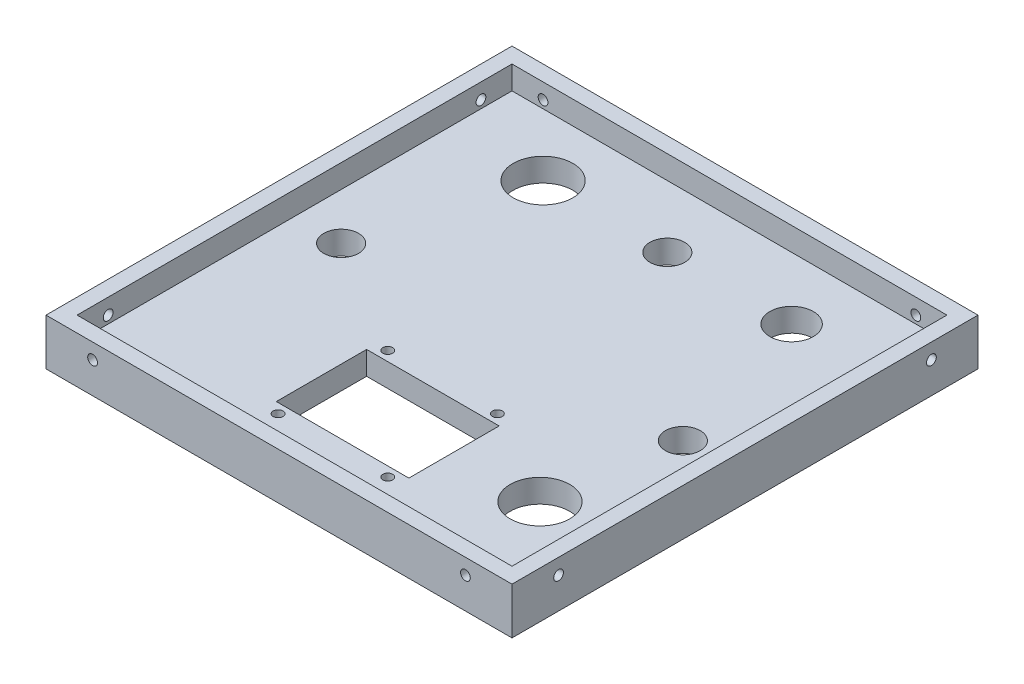
ISO-10303-21;
HEADER;
FILE_DESCRIPTION(('STEP AP214'),'2;1');
FILE_NAME('part.step','',(''),(''),'','','');
FILE_SCHEMA(('AUTOMOTIVE_DESIGN { 1 0 10303 214 1 1 1 1 }'));
ENDSEC;
DATA;
#1=APPLICATION_CONTEXT('core data for automotive mechanical design processes');
#2=APPLICATION_PROTOCOL_DEFINITION('international standard','automotive_design',2000,#1);
#3=PRODUCT_CONTEXT('',#1,'mechanical');
#4=PRODUCT('Part','Part','',(#3));
#5=PRODUCT_RELATED_PRODUCT_CATEGORY('part','',(#4));
#6=PRODUCT_DEFINITION_FORMATION('','',#4);
#7=PRODUCT_DEFINITION_CONTEXT('part definition',#1,'design');
#8=PRODUCT_DEFINITION('design','',#6,#7);
#9=PRODUCT_DEFINITION_SHAPE('','',#8);
#10=(LENGTH_UNIT() NAMED_UNIT(*) SI_UNIT(.MILLI.,.METRE.));
#11=(NAMED_UNIT(*) PLANE_ANGLE_UNIT() SI_UNIT($,.RADIAN.));
#12=(NAMED_UNIT(*) SI_UNIT($,.STERADIAN.) SOLID_ANGLE_UNIT());
#13=UNCERTAINTY_MEASURE_WITH_UNIT(LENGTH_MEASURE(1.E-05),#10,'distance_accuracy_value','');
#14=(GEOMETRIC_REPRESENTATION_CONTEXT(3) GLOBAL_UNCERTAINTY_ASSIGNED_CONTEXT((#13)) GLOBAL_UNIT_ASSIGNED_CONTEXT((#10,
#11,#12)) REPRESENTATION_CONTEXT('',''));
#15=CARTESIAN_POINT('',(0.,0.,0.));
#16=DIRECTION('',(0.,0.,1.));
#17=DIRECTION('',(1.,0.,0.));
#18=AXIS2_PLACEMENT_3D('',#15,#16,#17);
#19=CARTESIAN_POINT('',(0.,9.525,0.));
#20=DIRECTION('',(0.,1.,0.));
#21=DIRECTION('',(0.,0.,1.));
#22=AXIS2_PLACEMENT_3D('',#19,#20,#21);
#23=PLANE('',#22);
#24=DIRECTION('',(0.,0.,1.));
#25=VECTOR('',#24,1.);
#26=CARTESIAN_POINT('',(-47.625,9.525,-47.625));
#27=LINE('',#26,#25);
#28=CARTESIAN_POINT('',(-47.625,9.525,-47.625));
#29=VERTEX_POINT('',#28);
#30=CARTESIAN_POINT('',(-47.625,9.525,47.625));
#31=VERTEX_POINT('',#30);
#32=EDGE_CURVE('E243',#29,#31,#27,.T.);
#33=ORIENTED_EDGE('',*,*,#32,.T.);
#34=DIRECTION('',(1.,0.,0.));
#35=VECTOR('',#34,1.);
#36=CARTESIAN_POINT('',(-47.625,9.525,47.625));
#37=LINE('',#36,#35);
#38=CARTESIAN_POINT('',(47.625,9.525,47.625));
#39=VERTEX_POINT('',#38);
#40=EDGE_CURVE('E247',#31,#39,#37,.T.);
#41=ORIENTED_EDGE('',*,*,#40,.T.);
#42=DIRECTION('',(0.,0.,-1.));
#43=VECTOR('',#42,1.);
#44=CARTESIAN_POINT('',(47.625,9.525,-47.625));
#45=LINE('',#44,#43);
#46=CARTESIAN_POINT('',(47.625,9.525,-47.625));
#47=VERTEX_POINT('',#46);
#48=EDGE_CURVE('E252',#39,#47,#45,.T.);
#49=ORIENTED_EDGE('',*,*,#48,.T.);
#50=DIRECTION('',(-1.,0.,0.));
#51=VECTOR('',#50,1.);
#52=CARTESIAN_POINT('',(-47.625,9.525,-47.625));
#53=LINE('',#52,#51);
#54=EDGE_CURVE('E256',#47,#29,#53,.T.);
#55=ORIENTED_EDGE('',*,*,#54,.T.);
#56=EDGE_LOOP('',(#33,#41,#49,#55));
#57=FACE_BOUND('',#56,.T.);
#58=DIRECTION('',(1.,0.,0.));
#59=VECTOR('',#58,1.);
#60=CARTESIAN_POINT('',(-44.45,9.525,44.45));
#61=LINE('',#60,#59);
#62=CARTESIAN_POINT('',(-44.45,9.525,44.45));
#63=VERTEX_POINT('',#62);
#64=CARTESIAN_POINT('',(44.45,9.525,44.45));
#65=VERTEX_POINT('',#64);
#66=EDGE_CURVE('E356',#63,#65,#61,.T.);
#67=ORIENTED_EDGE('',*,*,#66,.F.);
#68=DIRECTION('',(0.,0.,1.));
#69=VECTOR('',#68,1.);
#70=CARTESIAN_POINT('',(-44.45,9.525,-44.45));
#71=LINE('',#70,#69);
#72=CARTESIAN_POINT('',(-44.45,9.525,-44.45));
#73=VERTEX_POINT('',#72);
#74=EDGE_CURVE('E350',#73,#63,#71,.T.);
#75=ORIENTED_EDGE('',*,*,#74,.F.);
#76=DIRECTION('',(-1.,0.,0.));
#77=VECTOR('',#76,1.);
#78=CARTESIAN_POINT('',(-44.45,9.525,-44.45));
#79=LINE('',#78,#77);
#80=CARTESIAN_POINT('',(44.45,9.525,-44.45));
#81=VERTEX_POINT('',#80);
#82=EDGE_CURVE('E363',#81,#73,#79,.T.);
#83=ORIENTED_EDGE('',*,*,#82,.F.);
#84=DIRECTION('',(0.,0.,-1.));
#85=VECTOR('',#84,1.);
#86=CARTESIAN_POINT('',(44.45,9.525,-44.45));
#87=LINE('',#86,#85);
#88=EDGE_CURVE('E359',#65,#81,#87,.T.);
#89=ORIENTED_EDGE('',*,*,#88,.F.);
#90=EDGE_LOOP('',(#67,#75,#83,#89));
#91=FACE_BOUND('',#90,.T.);
#92=ADVANCED_FACE('F45',(#57,#91),#23,.T.);
#93=CARTESIAN_POINT('',(-44.45,9.525,-44.45));
#94=DIRECTION('',(1.,0.,0.));
#95=DIRECTION('',(0.,0.,-1.));
#96=AXIS2_PLACEMENT_3D('',#93,#94,#95);
#97=PLANE('',#96);
#98=DIRECTION('',(0.,0.,1.));
#99=VECTOR('',#98,1.);
#100=CARTESIAN_POINT('',(-44.45,4.7625,-44.45));
#101=LINE('',#100,#99);
#102=CARTESIAN_POINT('',(-44.45,4.7625,-44.45));
#103=VERTEX_POINT('',#102);
#104=CARTESIAN_POINT('',(-44.45,4.7625,44.45));
#105=VERTEX_POINT('',#104);
#106=EDGE_CURVE('E305',#103,#105,#101,.T.);
#107=ORIENTED_EDGE('',*,*,#106,.F.);
#108=DIRECTION('',(0.,-1.,0.));
#109=VECTOR('',#108,1.);
#110=CARTESIAN_POINT('',(-44.45,9.525,-44.45));
#111=LINE('',#110,#109);
#112=EDGE_CURVE('E366',#73,#103,#111,.T.);
#113=ORIENTED_EDGE('',*,*,#112,.F.);
#114=ORIENTED_EDGE('',*,*,#74,.T.);
#115=DIRECTION('',(0.,-1.,0.));
#116=VECTOR('',#115,1.);
#117=CARTESIAN_POINT('',(-44.45,9.525,44.45));
#118=LINE('',#117,#116);
#119=EDGE_CURVE('E11',#63,#105,#118,.T.);
#120=ORIENTED_EDGE('',*,*,#119,.T.);
#121=EDGE_LOOP('',(#107,#113,#114,#120));
#122=FACE_BOUND('',#121,.T.);
#123=CARTESIAN_POINT('',(-44.4500000000001,6.35,38.0999999999998));
#124=DIRECTION('',(-1.,0.,0.));
#125=DIRECTION('',(0.,0.,-1.));
#126=AXIS2_PLACEMENT_3D('',#123,#124,#125);
#127=CIRCLE('',#126,0.99949);
#128=CARTESIAN_POINT('',(-44.4500000000001,6.35,37.1005099999998));
#129=VERTEX_POINT('',#128);
#130=EDGE_CURVE('E334',#129,#129,#127,.T.);
#131=ORIENTED_EDGE('',*,*,#130,.T.);
#132=EDGE_LOOP('',(#131));
#133=FACE_BOUND('',#132,.T.);
#134=CARTESIAN_POINT('',(-44.4499999999999,6.35,-38.1000000000002));
#135=DIRECTION('',(-1.,0.,0.));
#136=DIRECTION('',(0.,0.,1.));
#137=AXIS2_PLACEMENT_3D('',#134,#135,#136);
#138=CIRCLE('',#137,0.99949);
#139=CARTESIAN_POINT('',(-44.4499999999999,6.35,-37.1005100000001));
#140=VERTEX_POINT('',#139);
#141=EDGE_CURVE('E338',#140,#140,#138,.T.);
#142=ORIENTED_EDGE('',*,*,#141,.T.);
#143=EDGE_LOOP('',(#142));
#144=FACE_BOUND('',#143,.T.);
#145=ADVANCED_FACE('F424',(#122,#133,#144),#97,.T.);
#146=CARTESIAN_POINT('',(-44.45,9.525,44.45));
#147=DIRECTION('',(0.,0.,-1.));
#148=DIRECTION('',(-1.,0.,0.));
#149=AXIS2_PLACEMENT_3D('',#146,#147,#148);
#150=PLANE('',#149);
#151=DIRECTION('',(1.,0.,0.));
#152=VECTOR('',#151,1.);
#153=CARTESIAN_POINT('',(-44.45,4.7625,44.45));
#154=LINE('',#153,#152);
#155=CARTESIAN_POINT('',(44.45,4.7625,44.45));
#156=VERTEX_POINT('',#155);
#157=EDGE_CURVE('E309',#105,#156,#154,.T.);
#158=ORIENTED_EDGE('',*,*,#157,.F.);
#159=ORIENTED_EDGE('',*,*,#119,.F.);
#160=ORIENTED_EDGE('',*,*,#66,.T.);
#161=DIRECTION('',(0.,-1.,0.));
#162=VECTOR('',#161,1.);
#163=CARTESIAN_POINT('',(44.45,9.525,44.45));
#164=LINE('',#163,#162);
#165=EDGE_CURVE('E55',#65,#156,#164,.T.);
#166=ORIENTED_EDGE('',*,*,#165,.T.);
#167=EDGE_LOOP('',(#158,#159,#160,#166));
#168=FACE_BOUND('',#167,.T.);
#169=CARTESIAN_POINT('',(-38.1,6.35,44.45));
#170=DIRECTION('',(0.,0.,1.));
#171=DIRECTION('',(1.,0.,0.));
#172=AXIS2_PLACEMENT_3D('',#169,#170,#171);
#173=CIRCLE('',#172,0.99949);
#174=CARTESIAN_POINT('',(-37.10051,6.35,44.45));
#175=VERTEX_POINT('',#174);
#176=EDGE_CURVE('E346',#175,#175,#173,.T.);
#177=ORIENTED_EDGE('',*,*,#176,.T.);
#178=EDGE_LOOP('',(#177));
#179=FACE_BOUND('',#178,.T.);
#180=CARTESIAN_POINT('',(38.1,6.35,44.45));
#181=DIRECTION('',(0.,0.,1.));
#182=DIRECTION('',(-1.,0.,0.));
#183=AXIS2_PLACEMENT_3D('',#180,#181,#182);
#184=CIRCLE('',#183,0.99949);
#185=CARTESIAN_POINT('',(37.10051,6.35,44.45));
#186=VERTEX_POINT('',#185);
#187=EDGE_CURVE('E345',#186,#186,#184,.T.);
#188=ORIENTED_EDGE('',*,*,#187,.T.);
#189=EDGE_LOOP('',(#188));
#190=FACE_BOUND('',#189,.T.);
#191=ADVANCED_FACE('F420',(#168,#179,#190),#150,.T.);
#192=CARTESIAN_POINT('',(44.45,9.525,-44.45));
#193=DIRECTION('',(-1.,0.,0.));
#194=DIRECTION('',(0.,0.,1.));
#195=AXIS2_PLACEMENT_3D('',#192,#193,#194);
#196=PLANE('',#195);
#197=DIRECTION('',(0.,0.,-1.));
#198=VECTOR('',#197,1.);
#199=CARTESIAN_POINT('',(44.45,4.7625,-44.45));
#200=LINE('',#199,#198);
#201=CARTESIAN_POINT('',(44.45,4.7625,-44.45));
#202=VERTEX_POINT('',#201);
#203=EDGE_CURVE('E313',#156,#202,#200,.T.);
#204=ORIENTED_EDGE('',*,*,#203,.F.);
#205=ORIENTED_EDGE('',*,*,#165,.F.);
#206=ORIENTED_EDGE('',*,*,#88,.T.);
#207=DIRECTION('',(0.,-1.,0.));
#208=VECTOR('',#207,1.);
#209=CARTESIAN_POINT('',(44.45,9.525,-44.45));
#210=LINE('',#209,#208);
#211=EDGE_CURVE('E369',#81,#202,#210,.T.);
#212=ORIENTED_EDGE('',*,*,#211,.T.);
#213=EDGE_LOOP('',(#204,#205,#206,#212));
#214=FACE_BOUND('',#213,.T.);
#215=CARTESIAN_POINT('',(44.4499999999996,6.35,38.1000000000005));
#216=DIRECTION('',(1.,0.,0.));
#217=DIRECTION('',(0.,0.,-1.));
#218=AXIS2_PLACEMENT_3D('',#215,#216,#217);
#219=CIRCLE('',#218,0.99949);
#220=CARTESIAN_POINT('',(44.4499999999996,6.35,37.1005100000005));
#221=VERTEX_POINT('',#220);
#222=EDGE_CURVE('E325',#221,#221,#219,.T.);
#223=ORIENTED_EDGE('',*,*,#222,.T.);
#224=EDGE_LOOP('',(#223));
#225=FACE_BOUND('',#224,.T.);
#226=CARTESIAN_POINT('',(44.4500000000004,6.35,-38.0999999999995));
#227=DIRECTION('',(1.,0.,0.));
#228=DIRECTION('',(0.,0.,1.));
#229=AXIS2_PLACEMENT_3D('',#226,#227,#228);
#230=CIRCLE('',#229,0.99949);
#231=CARTESIAN_POINT('',(44.4500000000004,6.35,-37.1005099999995));
#232=VERTEX_POINT('',#231);
#233=EDGE_CURVE('E321',#232,#232,#230,.T.);
#234=ORIENTED_EDGE('',*,*,#233,.T.);
#235=EDGE_LOOP('',(#234));
#236=FACE_BOUND('',#235,.T.);
#237=ADVANCED_FACE('F410',(#214,#225,#236),#196,.T.);
#238=CARTESIAN_POINT('',(-44.45,9.525,-44.45));
#239=DIRECTION('',(0.,0.,1.));
#240=DIRECTION('',(1.,0.,0.));
#241=AXIS2_PLACEMENT_3D('',#238,#239,#240);
#242=PLANE('',#241);
#243=DIRECTION('',(-1.,0.,0.));
#244=VECTOR('',#243,1.);
#245=CARTESIAN_POINT('',(-44.45,4.7625,-44.45));
#246=LINE('',#245,#244);
#247=EDGE_CURVE('E317',#202,#103,#246,.T.);
#248=ORIENTED_EDGE('',*,*,#247,.F.);
#249=ORIENTED_EDGE('',*,*,#211,.F.);
#250=ORIENTED_EDGE('',*,*,#82,.T.);
#251=ORIENTED_EDGE('',*,*,#112,.T.);
#252=EDGE_LOOP('',(#248,#249,#250,#251));
#253=FACE_BOUND('',#252,.T.);
#254=CARTESIAN_POINT('',(-38.1,6.35,-44.45));
#255=DIRECTION('',(0.,0.,-1.));
#256=DIRECTION('',(1.,0.,0.));
#257=AXIS2_PLACEMENT_3D('',#254,#255,#256);
#258=CIRCLE('',#257,0.99949);
#259=CARTESIAN_POINT('',(-37.10051,6.35,-44.45));
#260=VERTEX_POINT('',#259);
#261=EDGE_CURVE('E326',#260,#260,#258,.T.);
#262=ORIENTED_EDGE('',*,*,#261,.T.);
#263=EDGE_LOOP('',(#262));
#264=FACE_BOUND('',#263,.T.);
#265=CARTESIAN_POINT('',(38.1,6.35,-44.45));
#266=DIRECTION('',(0.,0.,-1.));
#267=DIRECTION('',(-1.,0.,0.));
#268=AXIS2_PLACEMENT_3D('',#265,#266,#267);
#269=CIRCLE('',#268,0.99949);
#270=CARTESIAN_POINT('',(37.10051,6.35,-44.45));
#271=VERTEX_POINT('',#270);
#272=EDGE_CURVE('E330',#271,#271,#269,.T.);
#273=ORIENTED_EDGE('',*,*,#272,.T.);
#274=EDGE_LOOP('',(#273));
#275=FACE_BOUND('',#274,.T.);
#276=ADVANCED_FACE('F407',(#253,#264,#275),#242,.T.);
#277=CARTESIAN_POINT('',(38.1,6.35,44.45));
#278=DIRECTION('',(0.,0.,1.));
#279=DIRECTION('',(1.,0.,0.));
#280=AXIS2_PLACEMENT_3D('',#277,#278,#279);
#281=CYLINDRICAL_SURFACE('',#280,0.99949);
#282=CARTESIAN_POINT('',(38.1,6.35,47.625));
#283=DIRECTION('',(0.,0.,-1.));
#284=DIRECTION('',(-1.,0.,0.));
#285=AXIS2_PLACEMENT_3D('',#282,#283,#284);
#286=CIRCLE('',#285,0.99949);
#287=CARTESIAN_POINT('',(37.10051,6.35,47.625));
#288=VERTEX_POINT('',#287);
#289=EDGE_CURVE('E301',#288,#288,#286,.F.);
#290=ORIENTED_EDGE('',*,*,#289,.T.);
#291=EDGE_LOOP('',(#290));
#292=FACE_BOUND('',#291,.T.);
#293=ORIENTED_EDGE('',*,*,#187,.F.);
#294=EDGE_LOOP('',(#293));
#295=FACE_BOUND('',#294,.T.);
#296=ADVANCED_FACE('F409',(#292,#295),#281,.F.);
#297=CARTESIAN_POINT('',(-38.1,6.35,44.45));
#298=DIRECTION('',(0.,0.,1.));
#299=DIRECTION('',(1.,0.,0.));
#300=AXIS2_PLACEMENT_3D('',#297,#298,#299);
#301=CYLINDRICAL_SURFACE('',#300,0.99949);
#302=CARTESIAN_POINT('',(-38.1,6.35,47.625));
#303=DIRECTION('',(0.,0.,-1.));
#304=DIRECTION('',(-1.,0.,0.));
#305=AXIS2_PLACEMENT_3D('',#302,#303,#304);
#306=CIRCLE('',#305,0.99949);
#307=CARTESIAN_POINT('',(-39.09949,6.35,47.625));
#308=VERTEX_POINT('',#307);
#309=EDGE_CURVE('E49',#308,#308,#306,.F.);
#310=ORIENTED_EDGE('',*,*,#309,.T.);
#311=EDGE_LOOP('',(#310));
#312=FACE_BOUND('',#311,.T.);
#313=ORIENTED_EDGE('',*,*,#176,.F.);
#314=EDGE_LOOP('',(#313));
#315=FACE_BOUND('',#314,.T.);
#316=ADVANCED_FACE('F403',(#312,#315),#301,.F.);
#317=CARTESIAN_POINT('',(38.1,6.35,-44.45));
#318=DIRECTION('',(0.,0.,-1.));
#319=DIRECTION('',(-1.,0.,0.));
#320=AXIS2_PLACEMENT_3D('',#317,#318,#319);
#321=CYLINDRICAL_SURFACE('',#320,0.99949);
#322=CARTESIAN_POINT('',(38.1,6.35,-47.625));
#323=DIRECTION('',(0.,0.,1.));
#324=DIRECTION('',(1.,0.,0.));
#325=AXIS2_PLACEMENT_3D('',#322,#323,#324);
#326=CIRCLE('',#325,0.99949);
#327=CARTESIAN_POINT('',(39.09949,6.35,-47.625));
#328=VERTEX_POINT('',#327);
#329=EDGE_CURVE('E297',#328,#328,#326,.F.);
#330=ORIENTED_EDGE('',*,*,#329,.T.);
#331=EDGE_LOOP('',(#330));
#332=FACE_BOUND('',#331,.T.);
#333=ORIENTED_EDGE('',*,*,#272,.F.);
#334=EDGE_LOOP('',(#333));
#335=FACE_BOUND('',#334,.T.);
#336=ADVANCED_FACE('F400',(#332,#335),#321,.F.);
#337=CARTESIAN_POINT('',(-38.1,6.35,-44.45));
#338=DIRECTION('',(0.,0.,-1.));
#339=DIRECTION('',(-1.,0.,0.));
#340=AXIS2_PLACEMENT_3D('',#337,#338,#339);
#341=CYLINDRICAL_SURFACE('',#340,0.99949);
#342=CARTESIAN_POINT('',(-38.1,6.35,-47.625));
#343=DIRECTION('',(0.,0.,1.));
#344=DIRECTION('',(1.,0.,0.));
#345=AXIS2_PLACEMENT_3D('',#342,#343,#344);
#346=CIRCLE('',#345,0.99949);
#347=CARTESIAN_POINT('',(-37.10051,6.35,-47.625));
#348=VERTEX_POINT('',#347);
#349=EDGE_CURVE('E296',#348,#348,#346,.F.);
#350=ORIENTED_EDGE('',*,*,#349,.T.);
#351=EDGE_LOOP('',(#350));
#352=FACE_BOUND('',#351,.T.);
#353=ORIENTED_EDGE('',*,*,#261,.F.);
#354=EDGE_LOOP('',(#353));
#355=FACE_BOUND('',#354,.T.);
#356=ADVANCED_FACE('F385',(#352,#355),#341,.F.);
#357=CARTESIAN_POINT('',(44.4500000000004,6.35,-38.0999999999995));
#358=DIRECTION('',(1.,0.,0.));
#359=DIRECTION('',(0.,0.,-1.));
#360=AXIS2_PLACEMENT_3D('',#357,#358,#359);
#361=CYLINDRICAL_SURFACE('',#360,0.99949);
#362=CARTESIAN_POINT('',(47.625,6.35,-38.0999999999995));
#363=DIRECTION('',(-1.,0.,0.));
#364=DIRECTION('',(0.,0.,1.));
#365=AXIS2_PLACEMENT_3D('',#362,#363,#364);
#366=CIRCLE('',#365,0.99949);
#367=CARTESIAN_POINT('',(47.625,6.35,-37.1005099999995));
#368=VERTEX_POINT('',#367);
#369=EDGE_CURVE('E292',#368,#368,#366,.F.);
#370=ORIENTED_EDGE('',*,*,#369,.T.);
#371=EDGE_LOOP('',(#370));
#372=FACE_BOUND('',#371,.T.);
#373=ORIENTED_EDGE('',*,*,#233,.F.);
#374=EDGE_LOOP('',(#373));
#375=FACE_BOUND('',#374,.T.);
#376=ADVANCED_FACE('F463',(#372,#375),#361,.F.);
#377=CARTESIAN_POINT('',(44.4499999999996,6.35,38.1000000000005));
#378=DIRECTION('',(1.,0.,0.));
#379=DIRECTION('',(0.,0.,-1.));
#380=AXIS2_PLACEMENT_3D('',#377,#378,#379);
#381=CYLINDRICAL_SURFACE('',#380,0.99949);
#382=CARTESIAN_POINT('',(47.625,6.35,38.1000000000005));
#383=DIRECTION('',(-1.,0.,0.));
#384=DIRECTION('',(0.,0.,1.));
#385=AXIS2_PLACEMENT_3D('',#382,#383,#384);
#386=CIRCLE('',#385,0.99949);
#387=CARTESIAN_POINT('',(47.625,6.35,39.0994900000005));
#388=VERTEX_POINT('',#387);
#389=EDGE_CURVE('E291',#388,#388,#386,.F.);
#390=ORIENTED_EDGE('',*,*,#389,.T.);
#391=EDGE_LOOP('',(#390));
#392=FACE_BOUND('',#391,.T.);
#393=ORIENTED_EDGE('',*,*,#222,.F.);
#394=EDGE_LOOP('',(#393));
#395=FACE_BOUND('',#394,.T.);
#396=ADVANCED_FACE('F454',(#392,#395),#381,.F.);
#397=CARTESIAN_POINT('',(-44.4499999999999,6.35,-38.1000000000002));
#398=DIRECTION('',(-1.,0.,0.));
#399=DIRECTION('',(0.,0.,1.));
#400=AXIS2_PLACEMENT_3D('',#397,#398,#399);
#401=CYLINDRICAL_SURFACE('',#400,0.99949);
#402=CARTESIAN_POINT('',(-47.625,6.35,-38.1000000000002));
#403=DIRECTION('',(1.,0.,0.));
#404=DIRECTION('',(0.,0.,-1.));
#405=AXIS2_PLACEMENT_3D('',#402,#403,#404);
#406=CIRCLE('',#405,0.99949);
#407=CARTESIAN_POINT('',(-47.625,6.35,-39.0994900000002));
#408=VERTEX_POINT('',#407);
#409=EDGE_CURVE('E287',#408,#408,#406,.F.);
#410=ORIENTED_EDGE('',*,*,#409,.T.);
#411=EDGE_LOOP('',(#410));
#412=FACE_BOUND('',#411,.T.);
#413=ORIENTED_EDGE('',*,*,#141,.F.);
#414=EDGE_LOOP('',(#413));
#415=FACE_BOUND('',#414,.T.);
#416=ADVANCED_FACE('F451',(#412,#415),#401,.F.);
#417=CARTESIAN_POINT('',(-44.4500000000001,6.35,38.0999999999998));
#418=DIRECTION('',(-1.,0.,0.));
#419=DIRECTION('',(0.,0.,1.));
#420=AXIS2_PLACEMENT_3D('',#417,#418,#419);
#421=CYLINDRICAL_SURFACE('',#420,0.99949);
#422=CARTESIAN_POINT('',(-47.625,6.35,38.0999999999998));
#423=DIRECTION('',(1.,0.,0.));
#424=DIRECTION('',(0.,0.,-1.));
#425=AXIS2_PLACEMENT_3D('',#422,#423,#424);
#426=CIRCLE('',#425,0.99949);
#427=CARTESIAN_POINT('',(-47.625,6.35,37.1005099999998));
#428=VERTEX_POINT('',#427);
#429=EDGE_CURVE('E286',#428,#428,#426,.F.);
#430=ORIENTED_EDGE('',*,*,#429,.T.);
#431=EDGE_LOOP('',(#430));
#432=FACE_BOUND('',#431,.T.);
#433=ORIENTED_EDGE('',*,*,#130,.F.);
#434=EDGE_LOOP('',(#433));
#435=FACE_BOUND('',#434,.T.);
#436=ADVANCED_FACE('F453',(#432,#435),#421,.F.);
#437=CARTESIAN_POINT('',(0.,4.7625,0.));
#438=DIRECTION('',(0.,1.,0.));
#439=DIRECTION('',(0.,0.,1.));
#440=AXIS2_PLACEMENT_3D('',#437,#438,#439);
#441=PLANE('',#440);
#442=CARTESIAN_POINT('',(-34.925,4.7625,0.));
#443=DIRECTION('',(0.,1.,0.));
#444=DIRECTION('',(0.,0.,1.));
#445=AXIS2_PLACEMENT_3D('',#442,#443,#444);
#446=CIRCLE('',#445,3.55600000000001);
#447=CARTESIAN_POINT('',(-34.925,4.7625,3.556));
#448=VERTEX_POINT('',#447);
#449=EDGE_CURVE('E145',#448,#448,#446,.T.);
#450=ORIENTED_EDGE('',*,*,#449,.F.);
#451=EDGE_LOOP('',(#450));
#452=FACE_BOUND('',#451,.T.);
#453=CARTESIAN_POINT('',(34.925,4.7625,0.));
#454=DIRECTION('',(0.,1.,0.));
#455=DIRECTION('',(0.,0.,1.));
#456=AXIS2_PLACEMENT_3D('',#453,#454,#455);
#457=CIRCLE('',#456,3.55600000000001);
#458=CARTESIAN_POINT('',(34.925,4.7625,3.55600000000001));
#459=VERTEX_POINT('',#458);
#460=EDGE_CURVE('E543',#459,#459,#457,.T.);
#461=ORIENTED_EDGE('',*,*,#460,.F.);
#462=EDGE_LOOP('',(#461));
#463=FACE_BOUND('',#462,.T.);
#464=CARTESIAN_POINT('',(11.2056332918231,4.7625,14.1943667081769));
#465=DIRECTION('',(0.,1.,0.));
#466=DIRECTION('',(0.,0.,1.));
#467=AXIS2_PLACEMENT_3D('',#464,#465,#466);
#468=CIRCLE('',#467,0.999490000000001);
#469=CARTESIAN_POINT('',(11.2056332918231,4.7625,15.1938567081769));
#470=VERTEX_POINT('',#469);
#471=EDGE_CURVE('E206',#470,#470,#468,.T.);
#472=ORIENTED_EDGE('',*,*,#471,.F.);
#473=EDGE_LOOP('',(#472));
#474=FACE_BOUND('',#473,.T.);
#475=CARTESIAN_POINT('',(11.2056332918231,4.7625,36.6056332918231));
#476=DIRECTION('',(0.,1.,0.));
#477=DIRECTION('',(0.,0.,1.));
#478=AXIS2_PLACEMENT_3D('',#475,#476,#477);
#479=CIRCLE('',#478,0.999490000000001);
#480=CARTESIAN_POINT('',(11.2056332918231,4.7625,37.6051232918231));
#481=VERTEX_POINT('',#480);
#482=EDGE_CURVE('E202',#481,#481,#479,.T.);
#483=ORIENTED_EDGE('',*,*,#482,.F.);
#484=EDGE_LOOP('',(#483));
#485=FACE_BOUND('',#484,.T.);
#486=CARTESIAN_POINT('',(-11.2056332918231,4.7625,36.6056332918231));
#487=DIRECTION('',(0.,1.,0.));
#488=DIRECTION('',(0.,0.,1.));
#489=AXIS2_PLACEMENT_3D('',#486,#487,#488);
#490=CIRCLE('',#489,0.999490000000001);
#491=CARTESIAN_POINT('',(-11.2056332918231,4.7625,37.6051232918231));
#492=VERTEX_POINT('',#491);
#493=EDGE_CURVE('E198',#492,#492,#490,.T.);
#494=ORIENTED_EDGE('',*,*,#493,.F.);
#495=EDGE_LOOP('',(#494));
#496=FACE_BOUND('',#495,.T.);
#497=DIRECTION('',(0.,0.,1.));
#498=VECTOR('',#497,1.);
#499=CARTESIAN_POINT('',(-13.546709,4.7625,0.));
#500=LINE('',#499,#498);
#501=CARTESIAN_POINT('',(-13.546709,4.7625,16.171291));
#502=VERTEX_POINT('',#501);
#503=CARTESIAN_POINT('',(-13.546709,4.7625,34.628709));
#504=VERTEX_POINT('',#503);
#505=EDGE_CURVE('E140',#502,#504,#500,.T.);
#506=ORIENTED_EDGE('',*,*,#505,.F.);
#507=DIRECTION('',(-1.,0.,0.));
#508=VECTOR('',#507,1.);
#509=CARTESIAN_POINT('',(0.,4.7625,16.171291));
#510=LINE('',#509,#508);
#511=CARTESIAN_POINT('',(13.546709,4.7625,16.171291));
#512=VERTEX_POINT('',#511);
#513=EDGE_CURVE('E187',#512,#502,#510,.T.);
#514=ORIENTED_EDGE('',*,*,#513,.F.);
#515=DIRECTION('',(0.,0.,-1.));
#516=VECTOR('',#515,1.);
#517=CARTESIAN_POINT('',(13.546709,4.7625,0.));
#518=LINE('',#517,#516);
#519=CARTESIAN_POINT('',(13.546709,4.7625,34.628709));
#520=VERTEX_POINT('',#519);
#521=EDGE_CURVE('E190',#520,#512,#518,.T.);
#522=ORIENTED_EDGE('',*,*,#521,.F.);
#523=DIRECTION('',(1.,0.,0.));
#524=VECTOR('',#523,1.);
#525=CARTESIAN_POINT('',(0.,4.7625,34.628709));
#526=LINE('',#525,#524);
#527=EDGE_CURVE('E193',#504,#520,#526,.T.);
#528=ORIENTED_EDGE('',*,*,#527,.F.);
#529=EDGE_LOOP('',(#506,#514,#522,#528));
#530=FACE_BOUND('',#529,.T.);
#531=CARTESIAN_POINT('',(-11.2056332918231,4.7625,14.1943667081769));
#532=DIRECTION('',(0.,1.,0.));
#533=DIRECTION('',(0.,0.,1.));
#534=AXIS2_PLACEMENT_3D('',#531,#532,#533);
#535=CIRCLE('',#534,0.999490000000001);
#536=CARTESIAN_POINT('',(-11.2056332918231,4.7625,15.1938567081769));
#537=VERTEX_POINT('',#536);
#538=EDGE_CURVE('E183',#537,#537,#535,.T.);
#539=ORIENTED_EDGE('',*,*,#538,.F.);
#540=EDGE_LOOP('',(#539));
#541=FACE_BOUND('',#540,.T.);
#542=CARTESIAN_POINT('',(31.115,4.7625,25.4));
#543=DIRECTION('',(0.,1.,0.));
#544=DIRECTION('',(0.,0.,1.));
#545=AXIS2_PLACEMENT_3D('',#542,#543,#544);
#546=CIRCLE('',#545,6.09599999999999);
#547=CARTESIAN_POINT('',(31.115,4.7625,31.496));
#548=VERTEX_POINT('',#547);
#549=EDGE_CURVE('E238',#548,#548,#546,.T.);
#550=ORIENTED_EDGE('',*,*,#549,.F.);
#551=EDGE_LOOP('',(#550));
#552=FACE_BOUND('',#551,.T.);
#553=CARTESIAN_POINT('',(25.4,4.7625,-31.75));
#554=DIRECTION('',(0.,1.,0.));
#555=DIRECTION('',(0.,0.,1.));
#556=AXIS2_PLACEMENT_3D('',#553,#554,#555);
#557=CIRCLE('',#556,4.445);
#558=CARTESIAN_POINT('',(25.4,4.7625,-27.305));
#559=VERTEX_POINT('',#558);
#560=EDGE_CURVE('E234',#559,#559,#557,.T.);
#561=ORIENTED_EDGE('',*,*,#560,.F.);
#562=EDGE_LOOP('',(#561));
#563=FACE_BOUND('',#562,.T.);
#564=CARTESIAN_POINT('',(-25.4,4.7625,-31.75));
#565=DIRECTION('',(0.,1.,0.));
#566=DIRECTION('',(0.,0.,1.));
#567=AXIS2_PLACEMENT_3D('',#564,#565,#566);
#568=CIRCLE('',#567,6.096);
#569=CARTESIAN_POINT('',(-25.4,4.7625,-25.654));
#570=VERTEX_POINT('',#569);
#571=EDGE_CURVE('E230',#570,#570,#568,.T.);
#572=ORIENTED_EDGE('',*,*,#571,.F.);
#573=EDGE_LOOP('',(#572));
#574=FACE_BOUND('',#573,.T.);
#575=CARTESIAN_POINT('',(0.,4.7625,-31.75));
#576=DIRECTION('',(0.,1.,0.));
#577=DIRECTION('',(0.,0.,1.));
#578=AXIS2_PLACEMENT_3D('',#575,#576,#577);
#579=CIRCLE('',#578,3.556);
#580=CARTESIAN_POINT('',(0.,4.7625,-28.194));
#581=VERTEX_POINT('',#580);
#582=EDGE_CURVE('E226',#581,#581,#579,.T.);
#583=ORIENTED_EDGE('',*,*,#582,.F.);
#584=EDGE_LOOP('',(#583));
#585=FACE_BOUND('',#584,.T.);
#586=ORIENTED_EDGE('',*,*,#106,.T.);
#587=ORIENTED_EDGE('',*,*,#157,.T.);
#588=ORIENTED_EDGE('',*,*,#203,.T.);
#589=ORIENTED_EDGE('',*,*,#247,.T.);
#590=EDGE_LOOP('',(#586,#587,#588,#589));
#591=FACE_BOUND('',#590,.T.);
#592=ADVANCED_FACE('F459',(#452,#463,#474,#485,#496,#530,#541,#552,#563,#574,#585,#591),#441,.T.);
#593=CARTESIAN_POINT('',(-47.625,9.525,47.625));
#594=DIRECTION('',(0.,0.,-1.));
#595=DIRECTION('',(-1.,0.,0.));
#596=AXIS2_PLACEMENT_3D('',#593,#594,#595);
#597=PLANE('',#596);
#598=ORIENTED_EDGE('',*,*,#309,.F.);
#599=EDGE_LOOP('',(#598));
#600=FACE_BOUND('',#599,.T.);
#601=DIRECTION('',(1.,0.,0.));
#602=VECTOR('',#601,1.);
#603=CARTESIAN_POINT('',(-47.625,0.,47.625));
#604=LINE('',#603,#602);
#605=CARTESIAN_POINT('',(-47.625,0.,47.625));
#606=VERTEX_POINT('',#605);
#607=CARTESIAN_POINT('',(47.625,0.,47.625));
#608=VERTEX_POINT('',#607);
#609=EDGE_CURVE('E264',#606,#608,#604,.T.);
#610=ORIENTED_EDGE('',*,*,#609,.T.);
#611=DIRECTION('',(0.,-1.,0.));
#612=VECTOR('',#611,1.);
#613=CARTESIAN_POINT('',(47.625,9.525,47.625));
#614=LINE('',#613,#612);
#615=EDGE_CURVE('E280',#39,#608,#614,.T.);
#616=ORIENTED_EDGE('',*,*,#615,.F.);
#617=ORIENTED_EDGE('',*,*,#40,.F.);
#618=DIRECTION('',(0.,-1.,0.));
#619=VECTOR('',#618,1.);
#620=CARTESIAN_POINT('',(-47.625,9.525,47.625));
#621=LINE('',#620,#619);
#622=EDGE_CURVE('E283',#31,#606,#621,.T.);
#623=ORIENTED_EDGE('',*,*,#622,.T.);
#624=EDGE_LOOP('',(#610,#616,#617,#623));
#625=FACE_BOUND('',#624,.T.);
#626=ORIENTED_EDGE('',*,*,#289,.F.);
#627=EDGE_LOOP('',(#626));
#628=FACE_BOUND('',#627,.T.);
#629=ADVANCED_FACE('F392',(#600,#625,#628),#597,.F.);
#630=CARTESIAN_POINT('',(-47.625,9.525,-47.625));
#631=DIRECTION('',(0.,0.,1.));
#632=DIRECTION('',(1.,0.,0.));
#633=AXIS2_PLACEMENT_3D('',#630,#631,#632);
#634=PLANE('',#633);
#635=ORIENTED_EDGE('',*,*,#349,.F.);
#636=EDGE_LOOP('',(#635));
#637=FACE_BOUND('',#636,.T.);
#638=DIRECTION('',(-1.,0.,0.));
#639=VECTOR('',#638,1.);
#640=CARTESIAN_POINT('',(-47.625,0.,-47.625));
#641=LINE('',#640,#639);
#642=CARTESIAN_POINT('',(47.625,0.,-47.625));
#643=VERTEX_POINT('',#642);
#644=CARTESIAN_POINT('',(-47.625,0.,-47.625));
#645=VERTEX_POINT('',#644);
#646=EDGE_CURVE('E248',#643,#645,#641,.T.);
#647=ORIENTED_EDGE('',*,*,#646,.T.);
#648=DIRECTION('',(0.,-1.,0.));
#649=VECTOR('',#648,1.);
#650=CARTESIAN_POINT('',(-47.625,9.525,-47.625));
#651=LINE('',#650,#649);
#652=EDGE_CURVE('E260',#29,#645,#651,.T.);
#653=ORIENTED_EDGE('',*,*,#652,.F.);
#654=ORIENTED_EDGE('',*,*,#54,.F.);
#655=DIRECTION('',(0.,-1.,0.));
#656=VECTOR('',#655,1.);
#657=CARTESIAN_POINT('',(47.625,9.525,-47.625));
#658=LINE('',#657,#656);
#659=EDGE_CURVE('E276',#47,#643,#658,.T.);
#660=ORIENTED_EDGE('',*,*,#659,.T.);
#661=EDGE_LOOP('',(#647,#653,#654,#660));
#662=FACE_BOUND('',#661,.T.);
#663=ORIENTED_EDGE('',*,*,#329,.F.);
#664=EDGE_LOOP('',(#663));
#665=FACE_BOUND('',#664,.T.);
#666=ADVANCED_FACE('F388',(#637,#662,#665),#634,.F.);
#667=CARTESIAN_POINT('',(47.625,9.525,-47.625));
#668=DIRECTION('',(-1.,0.,0.));
#669=DIRECTION('',(0.,0.,1.));
#670=AXIS2_PLACEMENT_3D('',#667,#668,#669);
#671=PLANE('',#670);
#672=ORIENTED_EDGE('',*,*,#389,.F.);
#673=EDGE_LOOP('',(#672));
#674=FACE_BOUND('',#673,.T.);
#675=DIRECTION('',(0.,0.,-1.));
#676=VECTOR('',#675,1.);
#677=CARTESIAN_POINT('',(47.625,0.,-47.625));
#678=LINE('',#677,#676);
#679=EDGE_CURVE('E268',#608,#643,#678,.T.);
#680=ORIENTED_EDGE('',*,*,#679,.T.);
#681=ORIENTED_EDGE('',*,*,#659,.F.);
#682=ORIENTED_EDGE('',*,*,#48,.F.);
#683=ORIENTED_EDGE('',*,*,#615,.T.);
#684=EDGE_LOOP('',(#680,#681,#682,#683));
#685=FACE_BOUND('',#684,.T.);
#686=ORIENTED_EDGE('',*,*,#369,.F.);
#687=EDGE_LOOP('',(#686));
#688=FACE_BOUND('',#687,.T.);
#689=ADVANCED_FACE('F391',(#674,#685,#688),#671,.F.);
#690=CARTESIAN_POINT('',(-47.625,9.525,-47.625));
#691=DIRECTION('',(1.,0.,0.));
#692=DIRECTION('',(0.,0.,-1.));
#693=AXIS2_PLACEMENT_3D('',#690,#691,#692);
#694=PLANE('',#693);
#695=ORIENTED_EDGE('',*,*,#429,.F.);
#696=EDGE_LOOP('',(#695));
#697=FACE_BOUND('',#696,.T.);
#698=DIRECTION('',(0.,0.,1.));
#699=VECTOR('',#698,1.);
#700=CARTESIAN_POINT('',(-47.625,0.,-47.625));
#701=LINE('',#700,#699);
#702=EDGE_CURVE('E242',#645,#606,#701,.T.);
#703=ORIENTED_EDGE('',*,*,#702,.T.);
#704=ORIENTED_EDGE('',*,*,#622,.F.);
#705=ORIENTED_EDGE('',*,*,#32,.F.);
#706=ORIENTED_EDGE('',*,*,#652,.T.);
#707=EDGE_LOOP('',(#703,#704,#705,#706));
#708=FACE_BOUND('',#707,.T.);
#709=ORIENTED_EDGE('',*,*,#409,.F.);
#710=EDGE_LOOP('',(#709));
#711=FACE_BOUND('',#710,.T.);
#712=ADVANCED_FACE('F473',(#697,#708,#711),#694,.F.);
#713=CARTESIAN_POINT('',(0.,0.,0.));
#714=DIRECTION('',(0.,1.,0.));
#715=DIRECTION('',(0.,0.,1.));
#716=AXIS2_PLACEMENT_3D('',#713,#714,#715);
#717=PLANE('',#716);
#718=CARTESIAN_POINT('',(-34.925,0.,0.));
#719=DIRECTION('',(0.,-1.,0.));
#720=DIRECTION('',(0.,0.,-1.));
#721=AXIS2_PLACEMENT_3D('',#718,#719,#720);
#722=CIRCLE('',#721,3.55600000000001);
#723=CARTESIAN_POINT('',(-34.925,0.,-3.55600000000001));
#724=VERTEX_POINT('',#723);
#725=EDGE_CURVE('E540',#724,#724,#722,.T.);
#726=ORIENTED_EDGE('',*,*,#725,.F.);
#727=EDGE_LOOP('',(#726));
#728=FACE_BOUND('',#727,.T.);
#729=CARTESIAN_POINT('',(34.925,0.,0.));
#730=DIRECTION('',(0.,-1.,0.));
#731=DIRECTION('',(0.,0.,-1.));
#732=AXIS2_PLACEMENT_3D('',#729,#730,#731);
#733=CIRCLE('',#732,3.55600000000001);
#734=CARTESIAN_POINT('',(34.925,0.,-3.55600000000001));
#735=VERTEX_POINT('',#734);
#736=EDGE_CURVE('E544',#735,#735,#733,.T.);
#737=ORIENTED_EDGE('',*,*,#736,.F.);
#738=EDGE_LOOP('',(#737));
#739=FACE_BOUND('',#738,.T.);
#740=CARTESIAN_POINT('',(11.2056332918231,0.,14.1943667081769));
#741=DIRECTION('',(0.,-1.,0.));
#742=DIRECTION('',(0.,0.,1.));
#743=AXIS2_PLACEMENT_3D('',#740,#741,#742);
#744=CIRCLE('',#743,0.999490000000001);
#745=CARTESIAN_POINT('',(11.2056332918231,0.,15.1938567081769));
#746=VERTEX_POINT('',#745);
#747=EDGE_CURVE('E172',#746,#746,#744,.T.);
#748=ORIENTED_EDGE('',*,*,#747,.F.);
#749=EDGE_LOOP('',(#748));
#750=FACE_BOUND('',#749,.T.);
#751=CARTESIAN_POINT('',(11.2056332918231,0.,36.6056332918231));
#752=DIRECTION('',(0.,-1.,0.));
#753=DIRECTION('',(0.,0.,-1.));
#754=AXIS2_PLACEMENT_3D('',#751,#752,#753);
#755=CIRCLE('',#754,0.999490000000001);
#756=CARTESIAN_POINT('',(11.2056332918231,0.,35.6061432918231));
#757=VERTEX_POINT('',#756);
#758=EDGE_CURVE('E167',#757,#757,#755,.T.);
#759=ORIENTED_EDGE('',*,*,#758,.F.);
#760=EDGE_LOOP('',(#759));
#761=FACE_BOUND('',#760,.T.);
#762=CARTESIAN_POINT('',(-11.2056332918231,0.,36.6056332918231));
#763=DIRECTION('',(0.,-1.,0.));
#764=DIRECTION('',(0.,0.,1.));
#765=AXIS2_PLACEMENT_3D('',#762,#763,#764);
#766=CIRCLE('',#765,0.999490000000001);
#767=CARTESIAN_POINT('',(-11.2056332918231,0.,37.6051232918231));
#768=VERTEX_POINT('',#767);
#769=EDGE_CURVE('E162',#768,#768,#766,.T.);
#770=ORIENTED_EDGE('',*,*,#769,.F.);
#771=EDGE_LOOP('',(#770));
#772=FACE_BOUND('',#771,.T.);
#773=DIRECTION('',(1.,0.,0.));
#774=VECTOR('',#773,1.);
#775=CARTESIAN_POINT('',(13.546709,0.,16.171291));
#776=LINE('',#775,#774);
#777=CARTESIAN_POINT('',(-13.546709,0.,16.171291));
#778=VERTEX_POINT('',#777);
#779=CARTESIAN_POINT('',(13.546709,0.,16.171291));
#780=VERTEX_POINT('',#779);
#781=EDGE_CURVE('E160',#778,#780,#776,.T.);
#782=ORIENTED_EDGE('',*,*,#781,.F.);
#783=DIRECTION('',(0.,0.,-1.));
#784=VECTOR('',#783,1.);
#785=CARTESIAN_POINT('',(-13.546709,0.,16.171291));
#786=LINE('',#785,#784);
#787=CARTESIAN_POINT('',(-13.546709,0.,34.628709));
#788=VERTEX_POINT('',#787);
#789=EDGE_CURVE('E71',#788,#778,#786,.T.);
#790=ORIENTED_EDGE('',*,*,#789,.F.);
#791=DIRECTION('',(-1.,0.,0.));
#792=VECTOR('',#791,1.);
#793=CARTESIAN_POINT('',(13.546709,0.,34.628709));
#794=LINE('',#793,#792);
#795=CARTESIAN_POINT('',(13.546709,0.,34.628709));
#796=VERTEX_POINT('',#795);
#797=EDGE_CURVE('E148',#796,#788,#794,.T.);
#798=ORIENTED_EDGE('',*,*,#797,.F.);
#799=DIRECTION('',(0.,0.,1.));
#800=VECTOR('',#799,1.);
#801=CARTESIAN_POINT('',(13.546709,0.,16.171291));
#802=LINE('',#801,#800);
#803=EDGE_CURVE('E155',#780,#796,#802,.T.);
#804=ORIENTED_EDGE('',*,*,#803,.F.);
#805=EDGE_LOOP('',(#782,#790,#798,#804));
#806=FACE_BOUND('',#805,.T.);
#807=CARTESIAN_POINT('',(-11.2056332918231,0.,14.1943667081769));
#808=DIRECTION('',(0.,-1.,0.));
#809=DIRECTION('',(0.,0.,-1.));
#810=AXIS2_PLACEMENT_3D('',#807,#808,#809);
#811=CIRCLE('',#810,0.999490000000001);
#812=CARTESIAN_POINT('',(-11.2056332918231,0.,13.1948767081769));
#813=VERTEX_POINT('',#812);
#814=EDGE_CURVE('E176',#813,#813,#811,.T.);
#815=ORIENTED_EDGE('',*,*,#814,.F.);
#816=EDGE_LOOP('',(#815));
#817=FACE_BOUND('',#816,.T.);
#818=CARTESIAN_POINT('',(31.115,0.,25.4));
#819=DIRECTION('',(0.,-1.,0.));
#820=DIRECTION('',(0.,0.,-1.));
#821=AXIS2_PLACEMENT_3D('',#818,#819,#820);
#822=CIRCLE('',#821,6.09599999999999);
#823=CARTESIAN_POINT('',(31.115,0.,19.304));
#824=VERTEX_POINT('',#823);
#825=EDGE_CURVE('E210',#824,#824,#822,.T.);
#826=ORIENTED_EDGE('',*,*,#825,.F.);
#827=EDGE_LOOP('',(#826));
#828=FACE_BOUND('',#827,.T.);
#829=CARTESIAN_POINT('',(25.4,0.,-31.75));
#830=DIRECTION('',(0.,-1.,0.));
#831=DIRECTION('',(0.,0.,-1.));
#832=AXIS2_PLACEMENT_3D('',#829,#830,#831);
#833=CIRCLE('',#832,4.445);
#834=CARTESIAN_POINT('',(25.4,0.,-36.195));
#835=VERTEX_POINT('',#834);
#836=EDGE_CURVE('E216',#835,#835,#833,.T.);
#837=ORIENTED_EDGE('',*,*,#836,.F.);
#838=EDGE_LOOP('',(#837));
#839=FACE_BOUND('',#838,.T.);
#840=CARTESIAN_POINT('',(-25.4,0.,-31.75));
#841=DIRECTION('',(0.,-1.,0.));
#842=DIRECTION('',(0.,0.,-1.));
#843=AXIS2_PLACEMENT_3D('',#840,#841,#842);
#844=CIRCLE('',#843,6.096);
#845=CARTESIAN_POINT('',(-25.4,0.,-37.846));
#846=VERTEX_POINT('',#845);
#847=EDGE_CURVE('E211',#846,#846,#844,.T.);
#848=ORIENTED_EDGE('',*,*,#847,.F.);
#849=EDGE_LOOP('',(#848));
#850=FACE_BOUND('',#849,.T.);
#851=CARTESIAN_POINT('',(0.,0.,-31.75));
#852=DIRECTION('',(0.,-1.,0.));
#853=DIRECTION('',(0.,0.,-1.));
#854=AXIS2_PLACEMENT_3D('',#851,#852,#853);
#855=CIRCLE('',#854,3.556);
#856=CARTESIAN_POINT('',(0.,0.,-35.306));
#857=VERTEX_POINT('',#856);
#858=EDGE_CURVE('E215',#857,#857,#855,.T.);
#859=ORIENTED_EDGE('',*,*,#858,.F.);
#860=EDGE_LOOP('',(#859));
#861=FACE_BOUND('',#860,.T.);
#862=ORIENTED_EDGE('',*,*,#609,.F.);
#863=ORIENTED_EDGE('',*,*,#702,.F.);
#864=ORIENTED_EDGE('',*,*,#646,.F.);
#865=ORIENTED_EDGE('',*,*,#679,.F.);
#866=EDGE_LOOP('',(#862,#863,#864,#865));
#867=FACE_BOUND('',#866,.T.);
#868=ADVANCED_FACE('F47',(#728,#739,#750,#761,#772,#806,#817,#828,#839,#850,#861,#867),#717,.F.);
#869=CARTESIAN_POINT('',(0.,9.525,-31.75));
#870=DIRECTION('',(0.,-1.,0.));
#871=DIRECTION('',(0.,0.,-1.));
#872=AXIS2_PLACEMENT_3D('',#869,#870,#871);
#873=CYLINDRICAL_SURFACE('',#872,3.556);
#874=ORIENTED_EDGE('',*,*,#582,.T.);
#875=EDGE_LOOP('',(#874));
#876=FACE_BOUND('',#875,.T.);
#877=ORIENTED_EDGE('',*,*,#858,.T.);
#878=EDGE_LOOP('',(#877));
#879=FACE_BOUND('',#878,.T.);
#880=ADVANCED_FACE('F483',(#876,#879),#873,.F.);
#881=CARTESIAN_POINT('',(-25.4,9.525,-31.75));
#882=DIRECTION('',(0.,-1.,0.));
#883=DIRECTION('',(0.,0.,-1.));
#884=AXIS2_PLACEMENT_3D('',#881,#882,#883);
#885=CYLINDRICAL_SURFACE('',#884,6.096);
#886=ORIENTED_EDGE('',*,*,#571,.T.);
#887=EDGE_LOOP('',(#886));
#888=FACE_BOUND('',#887,.T.);
#889=ORIENTED_EDGE('',*,*,#847,.T.);
#890=EDGE_LOOP('',(#889));
#891=FACE_BOUND('',#890,.T.);
#892=ADVANCED_FACE('F486',(#888,#891),#885,.F.);
#893=CARTESIAN_POINT('',(25.4,9.525,-31.75));
#894=DIRECTION('',(0.,-1.,0.));
#895=DIRECTION('',(0.,0.,-1.));
#896=AXIS2_PLACEMENT_3D('',#893,#894,#895);
#897=CYLINDRICAL_SURFACE('',#896,4.445);
#898=ORIENTED_EDGE('',*,*,#560,.T.);
#899=EDGE_LOOP('',(#898));
#900=FACE_BOUND('',#899,.T.);
#901=ORIENTED_EDGE('',*,*,#836,.T.);
#902=EDGE_LOOP('',(#901));
#903=FACE_BOUND('',#902,.T.);
#904=ADVANCED_FACE('F492',(#900,#903),#897,.F.);
#905=CARTESIAN_POINT('',(31.115,9.525,25.4));
#906=DIRECTION('',(0.,-1.,0.));
#907=DIRECTION('',(0.,0.,-1.));
#908=AXIS2_PLACEMENT_3D('',#905,#906,#907);
#909=CYLINDRICAL_SURFACE('',#908,6.09599999999999);
#910=ORIENTED_EDGE('',*,*,#549,.T.);
#911=EDGE_LOOP('',(#910));
#912=FACE_BOUND('',#911,.T.);
#913=ORIENTED_EDGE('',*,*,#825,.T.);
#914=EDGE_LOOP('',(#913));
#915=FACE_BOUND('',#914,.T.);
#916=ADVANCED_FACE('F488',(#912,#915),#909,.F.);
#917=CARTESIAN_POINT('',(-11.2056332918231,9.525,14.1943667081769));
#918=DIRECTION('',(0.,-1.,0.));
#919=DIRECTION('',(0.,0.,-1.));
#920=AXIS2_PLACEMENT_3D('',#917,#918,#919);
#921=CYLINDRICAL_SURFACE('',#920,0.999490000000001);
#922=ORIENTED_EDGE('',*,*,#538,.T.);
#923=EDGE_LOOP('',(#922));
#924=FACE_BOUND('',#923,.T.);
#925=ORIENTED_EDGE('',*,*,#814,.T.);
#926=EDGE_LOOP('',(#925));
#927=FACE_BOUND('',#926,.T.);
#928=ADVANCED_FACE('F491',(#924,#927),#921,.F.);
#929=CARTESIAN_POINT('',(-13.546709,9.525,16.171291));
#930=DIRECTION('',(-1.,0.,0.));
#931=DIRECTION('',(0.,0.,1.));
#932=AXIS2_PLACEMENT_3D('',#929,#930,#931);
#933=PLANE('',#932);
#934=ORIENTED_EDGE('',*,*,#505,.T.);
#935=DIRECTION('',(0.,-1.,0.));
#936=VECTOR('',#935,1.);
#937=CARTESIAN_POINT('',(-13.546709,9.525,34.628709));
#938=LINE('',#937,#936);
#939=EDGE_CURVE('E136',#504,#788,#938,.T.);
#940=ORIENTED_EDGE('',*,*,#939,.T.);
#941=ORIENTED_EDGE('',*,*,#789,.T.);
#942=DIRECTION('',(0.,-1.,0.));
#943=VECTOR('',#942,1.);
#944=CARTESIAN_POINT('',(-13.546709,9.525,16.171291));
#945=LINE('',#944,#943);
#946=EDGE_CURVE('E156',#502,#778,#945,.T.);
#947=ORIENTED_EDGE('',*,*,#946,.F.);
#948=EDGE_LOOP('',(#934,#940,#941,#947));
#949=FACE_BOUND('',#948,.T.);
#950=ADVANCED_FACE('F138',(#949),#933,.F.);
#951=CARTESIAN_POINT('',(13.546709,9.525,34.628709));
#952=DIRECTION('',(0.,0.,1.));
#953=DIRECTION('',(1.,0.,0.));
#954=AXIS2_PLACEMENT_3D('',#951,#952,#953);
#955=PLANE('',#954);
#956=ORIENTED_EDGE('',*,*,#527,.T.);
#957=DIRECTION('',(0.,-1.,0.));
#958=VECTOR('',#957,1.);
#959=CARTESIAN_POINT('',(13.546709,9.525,34.628709));
#960=LINE('',#959,#958);
#961=EDGE_CURVE('E144',#520,#796,#960,.T.);
#962=ORIENTED_EDGE('',*,*,#961,.T.);
#963=ORIENTED_EDGE('',*,*,#797,.T.);
#964=ORIENTED_EDGE('',*,*,#939,.F.);
#965=EDGE_LOOP('',(#956,#962,#963,#964));
#966=FACE_BOUND('',#965,.T.);
#967=ADVANCED_FACE('F149',(#966),#955,.F.);
#968=CARTESIAN_POINT('',(13.546709,9.525,16.171291));
#969=DIRECTION('',(1.,0.,0.));
#970=DIRECTION('',(0.,0.,-1.));
#971=AXIS2_PLACEMENT_3D('',#968,#969,#970);
#972=PLANE('',#971);
#973=ORIENTED_EDGE('',*,*,#521,.T.);
#974=DIRECTION('',(0.,-1.,0.));
#975=VECTOR('',#974,1.);
#976=CARTESIAN_POINT('',(13.546709,9.525,16.171291));
#977=LINE('',#976,#975);
#978=EDGE_CURVE('E63',#512,#780,#977,.T.);
#979=ORIENTED_EDGE('',*,*,#978,.T.);
#980=ORIENTED_EDGE('',*,*,#803,.T.);
#981=ORIENTED_EDGE('',*,*,#961,.F.);
#982=EDGE_LOOP('',(#973,#979,#980,#981));
#983=FACE_BOUND('',#982,.T.);
#984=ADVANCED_FACE('F515',(#983),#972,.F.);
#985=CARTESIAN_POINT('',(13.546709,9.525,16.171291));
#986=DIRECTION('',(0.,0.,-1.));
#987=DIRECTION('',(-1.,0.,0.));
#988=AXIS2_PLACEMENT_3D('',#985,#986,#987);
#989=PLANE('',#988);
#990=ORIENTED_EDGE('',*,*,#513,.T.);
#991=ORIENTED_EDGE('',*,*,#946,.T.);
#992=ORIENTED_EDGE('',*,*,#781,.T.);
#993=ORIENTED_EDGE('',*,*,#978,.F.);
#994=EDGE_LOOP('',(#990,#991,#992,#993));
#995=FACE_BOUND('',#994,.T.);
#996=ADVANCED_FACE('F518',(#995),#989,.F.);
#997=CARTESIAN_POINT('',(-11.2056332918231,9.525,36.6056332918231));
#998=DIRECTION('',(0.,-1.,0.));
#999=DIRECTION('',(0.,0.,-1.));
#1000=AXIS2_PLACEMENT_3D('',#997,#998,#999);
#1001=CYLINDRICAL_SURFACE('',#1000,0.999490000000001);
#1002=ORIENTED_EDGE('',*,*,#493,.T.);
#1003=EDGE_LOOP('',(#1002));
#1004=FACE_BOUND('',#1003,.T.);
#1005=ORIENTED_EDGE('',*,*,#769,.T.);
#1006=EDGE_LOOP('',(#1005));
#1007=FACE_BOUND('',#1006,.T.);
#1008=ADVANCED_FACE('F507',(#1004,#1007),#1001,.F.);
#1009=CARTESIAN_POINT('',(11.2056332918231,9.525,36.6056332918231));
#1010=DIRECTION('',(0.,-1.,0.));
#1011=DIRECTION('',(0.,0.,-1.));
#1012=AXIS2_PLACEMENT_3D('',#1009,#1010,#1011);
#1013=CYLINDRICAL_SURFACE('',#1012,0.999490000000001);
#1014=ORIENTED_EDGE('',*,*,#482,.T.);
#1015=EDGE_LOOP('',(#1014));
#1016=FACE_BOUND('',#1015,.T.);
#1017=ORIENTED_EDGE('',*,*,#758,.T.);
#1018=EDGE_LOOP('',(#1017));
#1019=FACE_BOUND('',#1018,.T.);
#1020=ADVANCED_FACE('F503',(#1016,#1019),#1013,.F.);
#1021=CARTESIAN_POINT('',(11.2056332918231,9.525,14.1943667081769));
#1022=DIRECTION('',(0.,-1.,0.));
#1023=DIRECTION('',(0.,0.,-1.));
#1024=AXIS2_PLACEMENT_3D('',#1021,#1022,#1023);
#1025=CYLINDRICAL_SURFACE('',#1024,0.999490000000001);
#1026=ORIENTED_EDGE('',*,*,#471,.T.);
#1027=EDGE_LOOP('',(#1026));
#1028=FACE_BOUND('',#1027,.T.);
#1029=ORIENTED_EDGE('',*,*,#747,.T.);
#1030=EDGE_LOOP('',(#1029));
#1031=FACE_BOUND('',#1030,.T.);
#1032=ADVANCED_FACE('F506',(#1028,#1031),#1025,.F.);
#1033=CARTESIAN_POINT('',(34.925,9.525,0.));
#1034=DIRECTION('',(0.,-1.,0.));
#1035=DIRECTION('',(0.,0.,-1.));
#1036=AXIS2_PLACEMENT_3D('',#1033,#1034,#1035);
#1037=CYLINDRICAL_SURFACE('',#1036,3.55600000000001);
#1038=ORIENTED_EDGE('',*,*,#460,.T.);
#1039=EDGE_LOOP('',(#1038));
#1040=FACE_BOUND('',#1039,.T.);
#1041=ORIENTED_EDGE('',*,*,#736,.T.);
#1042=EDGE_LOOP('',(#1041));
#1043=FACE_BOUND('',#1042,.T.);
#1044=ADVANCED_FACE('F511',(#1040,#1043),#1037,.F.);
#1045=CARTESIAN_POINT('',(-34.925,9.525,0.));
#1046=DIRECTION('',(0.,-1.,0.));
#1047=DIRECTION('',(0.,0.,-1.));
#1048=AXIS2_PLACEMENT_3D('',#1045,#1046,#1047);
#1049=CYLINDRICAL_SURFACE('',#1048,3.55600000000001);
#1050=ORIENTED_EDGE('',*,*,#449,.T.);
#1051=EDGE_LOOP('',(#1050));
#1052=FACE_BOUND('',#1051,.T.);
#1053=ORIENTED_EDGE('',*,*,#725,.T.);
#1054=EDGE_LOOP('',(#1053));
#1055=FACE_BOUND('',#1054,.T.);
#1056=ADVANCED_FACE('F529',(#1052,#1055),#1049,.F.);
#1057=CLOSED_SHELL('',(#92,#145,#191,#237,#276,#296,#316,#336,#356,#376,#396,#416,#436,#592,
#629,#666,#689,#712,#868,#880,#892,#904,#916,#928,#950,#967,#984,#996,#1008,#1020,#1032,#1044,#1056));
#1058=MANIFOLD_SOLID_BREP('B2',#1057);
#1059=ADVANCED_BREP_SHAPE_REPRESENTATION('',(#18,#1058),#14);
#1060=SHAPE_DEFINITION_REPRESENTATION(#9,#1059);
ENDSEC;
END-ISO-10303-21;
